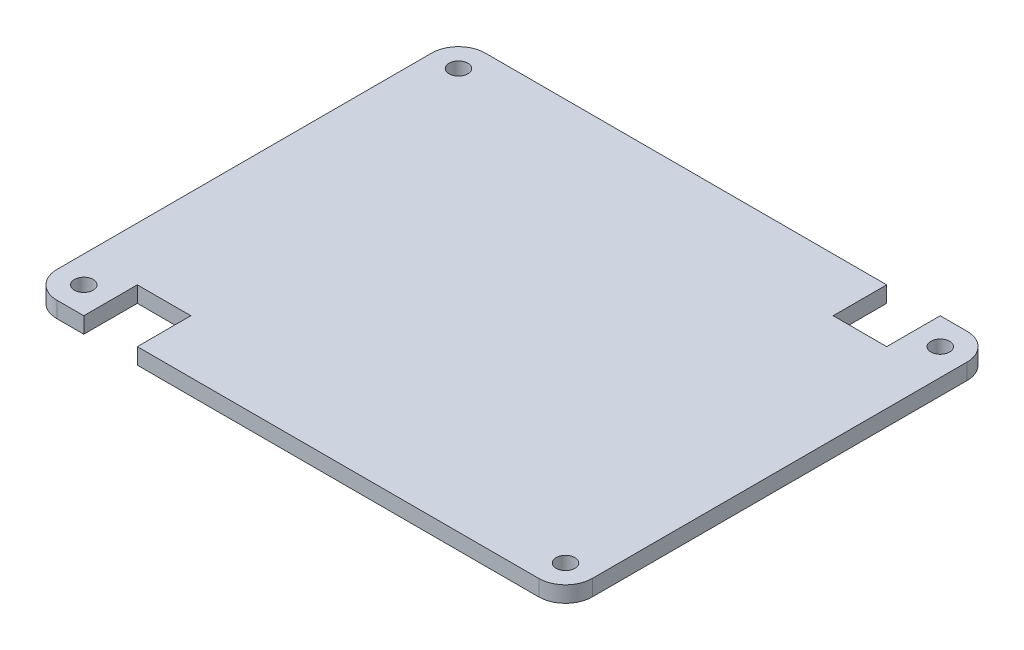
ISO-10303-21;
HEADER;
FILE_DESCRIPTION(('STEP AP214'),'2;1');
FILE_NAME('part.step','',(''),(''),'','','');
FILE_SCHEMA(('AUTOMOTIVE_DESIGN { 1 0 10303 214 1 1 1 1 }'));
ENDSEC;
DATA;
#1=APPLICATION_CONTEXT('core data for automotive mechanical design processes');
#2=APPLICATION_PROTOCOL_DEFINITION('international standard','automotive_design',2000,#1);
#3=PRODUCT_CONTEXT('',#1,'mechanical');
#4=PRODUCT('Part','Part','',(#3));
#5=PRODUCT_RELATED_PRODUCT_CATEGORY('part','',(#4));
#6=PRODUCT_DEFINITION_FORMATION('','',#4);
#7=PRODUCT_DEFINITION_CONTEXT('part definition',#1,'design');
#8=PRODUCT_DEFINITION('design','',#6,#7);
#9=PRODUCT_DEFINITION_SHAPE('','',#8);
#10=(LENGTH_UNIT() NAMED_UNIT(*) SI_UNIT(.MILLI.,.METRE.));
#11=(NAMED_UNIT(*) PLANE_ANGLE_UNIT() SI_UNIT($,.RADIAN.));
#12=(NAMED_UNIT(*) SI_UNIT($,.STERADIAN.) SOLID_ANGLE_UNIT());
#13=UNCERTAINTY_MEASURE_WITH_UNIT(LENGTH_MEASURE(1.E-05),#10,'distance_accuracy_value','');
#14=(GEOMETRIC_REPRESENTATION_CONTEXT(3) GLOBAL_UNCERTAINTY_ASSIGNED_CONTEXT((#13)) GLOBAL_UNIT_ASSIGNED_CONTEXT((#10,
#11,#12)) REPRESENTATION_CONTEXT('',''));
#15=CARTESIAN_POINT('',(0.,0.,0.));
#16=DIRECTION('',(0.,0.,1.));
#17=DIRECTION('',(1.,0.,0.));
#18=AXIS2_PLACEMENT_3D('',#15,#16,#17);
#19=CARTESIAN_POINT('',(-45.,3.,-40.));
#20=DIRECTION('',(0.,0.,1.));
#21=DIRECTION('',(1.,0.,0.));
#22=AXIS2_PLACEMENT_3D('',#19,#20,#21);
#23=PLANE('',#22);
#24=DIRECTION('',(-1.,0.,0.));
#25=VECTOR('',#24,1.);
#26=CARTESIAN_POINT('',(-45.,3.,-40.));
#27=LINE('',#26,#25);
#28=CARTESIAN_POINT('',(30.,3.,-40.));
#29=VERTEX_POINT('',#28);
#30=CARTESIAN_POINT('',(-45.,3.,-40.));
#31=VERTEX_POINT('',#30);
#32=EDGE_CURVE('E238',#29,#31,#27,.T.);
#33=ORIENTED_EDGE('',*,*,#32,.F.);
#34=DIRECTION('',(0.,1.,0.));
#35=VECTOR('',#34,1.);
#36=CARTESIAN_POINT('',(30.,0.,-40.));
#37=LINE('',#36,#35);
#38=CARTESIAN_POINT('',(30.,0.,-40.));
#39=VERTEX_POINT('',#38);
#40=EDGE_CURVE('E272',#39,#29,#37,.T.);
#41=ORIENTED_EDGE('',*,*,#40,.F.);
#42=DIRECTION('',(-1.,0.,0.));
#43=VECTOR('',#42,1.);
#44=CARTESIAN_POINT('',(-45.,0.,-40.));
#45=LINE('',#44,#43);
#46=CARTESIAN_POINT('',(-45.,0.,-40.));
#47=VERTEX_POINT('',#46);
#48=EDGE_CURVE('E213',#39,#47,#45,.T.);
#49=ORIENTED_EDGE('',*,*,#48,.T.);
#50=DIRECTION('',(0.,-1.,0.));
#51=VECTOR('',#50,1.);
#52=CARTESIAN_POINT('',(-45.,3.,-40.));
#53=LINE('',#52,#51);
#54=EDGE_CURVE('E41',#31,#47,#53,.T.);
#55=ORIENTED_EDGE('',*,*,#54,.F.);
#56=EDGE_LOOP('',(#33,#41,#49,#55));
#57=FACE_BOUND('',#56,.T.);
#58=ADVANCED_FACE('F33',(#57),#23,.F.);
#59=CARTESIAN_POINT('',(-45.,3.,40.));
#60=DIRECTION('',(0.,0.,-1.));
#61=DIRECTION('',(-1.,0.,0.));
#62=AXIS2_PLACEMENT_3D('',#59,#60,#61);
#63=PLANE('',#62);
#64=DIRECTION('',(1.,0.,0.));
#65=VECTOR('',#64,1.);
#66=CARTESIAN_POINT('',(-45.,0.,40.));
#67=LINE('',#66,#65);
#68=CARTESIAN_POINT('',(-45.,0.,40.));
#69=VERTEX_POINT('',#68);
#70=CARTESIAN_POINT('',(-40.,0.,40.));
#71=VERTEX_POINT('',#70);
#72=EDGE_CURVE('E163',#69,#71,#67,.T.);
#73=ORIENTED_EDGE('',*,*,#72,.T.);
#74=DIRECTION('',(0.,1.,0.));
#75=VECTOR('',#74,1.);
#76=CARTESIAN_POINT('',(-40.,0.,40.));
#77=LINE('',#76,#75);
#78=CARTESIAN_POINT('',(-40.,3.,40.));
#79=VERTEX_POINT('',#78);
#80=EDGE_CURVE('E146',#71,#79,#77,.T.);
#81=ORIENTED_EDGE('',*,*,#80,.T.);
#82=DIRECTION('',(1.,0.,0.));
#83=VECTOR('',#82,1.);
#84=CARTESIAN_POINT('',(-45.,3.,40.));
#85=LINE('',#84,#83);
#86=CARTESIAN_POINT('',(-45.,3.,40.));
#87=VERTEX_POINT('',#86);
#88=EDGE_CURVE('E227',#87,#79,#85,.T.);
#89=ORIENTED_EDGE('',*,*,#88,.F.);
#90=DIRECTION('',(0.,-1.,0.));
#91=VECTOR('',#90,1.);
#92=CARTESIAN_POINT('',(-45.,3.,40.));
#93=LINE('',#92,#91);
#94=EDGE_CURVE('E171',#87,#69,#93,.T.);
#95=ORIENTED_EDGE('',*,*,#94,.T.);
#96=EDGE_LOOP('',(#73,#81,#89,#95));
#97=FACE_BOUND('',#96,.T.);
#98=ADVANCED_FACE('F169',(#97),#63,.F.);
#99=CARTESIAN_POINT('',(45.,3.,-35.));
#100=DIRECTION('',(0.,-1.,0.));
#101=DIRECTION('',(0.,0.,-1.));
#102=AXIS2_PLACEMENT_3D('',#99,#100,#101);
#103=CYLINDRICAL_SURFACE('',#102,5.);
#104=CARTESIAN_POINT('',(45.,0.,-35.));
#105=DIRECTION('',(0.,1.,0.));
#106=DIRECTION('',(0.,0.,-1.));
#107=AXIS2_PLACEMENT_3D('',#104,#105,#106);
#108=CIRCLE('',#107,5.);
#109=CARTESIAN_POINT('',(50.,0.,-35.));
#110=VERTEX_POINT('',#109);
#111=CARTESIAN_POINT('',(45.,0.,-40.));
#112=VERTEX_POINT('',#111);
#113=EDGE_CURVE('E220',#110,#112,#108,.T.);
#114=ORIENTED_EDGE('',*,*,#113,.T.);
#115=DIRECTION('',(0.,-1.,0.));
#116=VECTOR('',#115,1.);
#117=CARTESIAN_POINT('',(45.,3.,-40.));
#118=LINE('',#117,#116);
#119=CARTESIAN_POINT('',(45.,3.,-40.));
#120=VERTEX_POINT('',#119);
#121=EDGE_CURVE('E11',#120,#112,#118,.T.);
#122=ORIENTED_EDGE('',*,*,#121,.F.);
#123=CARTESIAN_POINT('',(45.,3.,-35.));
#124=DIRECTION('',(0.,1.,0.));
#125=DIRECTION('',(0.,0.,-1.));
#126=AXIS2_PLACEMENT_3D('',#123,#124,#125);
#127=CIRCLE('',#126,5.);
#128=CARTESIAN_POINT('',(50.,3.,-35.));
#129=VERTEX_POINT('',#128);
#130=EDGE_CURVE('E182',#129,#120,#127,.T.);
#131=ORIENTED_EDGE('',*,*,#130,.F.);
#132=DIRECTION('',(0.,-1.,0.));
#133=VECTOR('',#132,1.);
#134=CARTESIAN_POINT('',(50.,3.,-35.));
#135=LINE('',#134,#133);
#136=EDGE_CURVE('E183',#129,#110,#135,.T.);
#137=ORIENTED_EDGE('',*,*,#136,.T.);
#138=EDGE_LOOP('',(#114,#122,#131,#137));
#139=FACE_BOUND('',#138,.T.);
#140=ADVANCED_FACE('F35',(#139),#103,.T.);
#141=CARTESIAN_POINT('',(40.,0.,-40.));
#142=VERTEX_POINT('',#141);
#143=EDGE_CURVE('E215',#112,#142,#45,.T.);
#144=ORIENTED_EDGE('',*,*,#143,.T.);
#145=DIRECTION('',(0.,1.,0.));
#146=VECTOR('',#145,1.);
#147=CARTESIAN_POINT('',(40.,0.,-40.));
#148=LINE('',#147,#146);
#149=CARTESIAN_POINT('',(40.,3.,-40.));
#150=VERTEX_POINT('',#149);
#151=EDGE_CURVE('E269',#142,#150,#148,.T.);
#152=ORIENTED_EDGE('',*,*,#151,.T.);
#153=EDGE_CURVE('E235',#120,#150,#27,.T.);
#154=ORIENTED_EDGE('',*,*,#153,.F.);
#155=ORIENTED_EDGE('',*,*,#121,.T.);
#156=EDGE_LOOP('',(#144,#152,#154,#155));
#157=FACE_BOUND('',#156,.T.);
#158=ADVANCED_FACE('F325',(#157),#23,.F.);
#159=CARTESIAN_POINT('',(-45.,3.,-35.));
#160=DIRECTION('',(0.,-1.,0.));
#161=DIRECTION('',(0.,0.,-1.));
#162=AXIS2_PLACEMENT_3D('',#159,#160,#161);
#163=CYLINDRICAL_SURFACE('',#162,4.99999999999999);
#164=CARTESIAN_POINT('',(-45.,0.,-35.));
#165=DIRECTION('',(0.,1.,0.));
#166=DIRECTION('',(0.,0.,1.));
#167=AXIS2_PLACEMENT_3D('',#164,#165,#166);
#168=CIRCLE('',#167,4.99999999999999);
#169=CARTESIAN_POINT('',(-50.,0.,-35.));
#170=VERTEX_POINT('',#169);
#171=EDGE_CURVE('E206',#47,#170,#168,.T.);
#172=ORIENTED_EDGE('',*,*,#171,.T.);
#173=DIRECTION('',(0.,-1.,0.));
#174=VECTOR('',#173,1.);
#175=CARTESIAN_POINT('',(-50.,3.,-35.));
#176=LINE('',#175,#174);
#177=CARTESIAN_POINT('',(-50.,3.,-35.));
#178=VERTEX_POINT('',#177);
#179=EDGE_CURVE('E197',#178,#170,#176,.T.);
#180=ORIENTED_EDGE('',*,*,#179,.F.);
#181=CARTESIAN_POINT('',(-45.,3.,-35.));
#182=DIRECTION('',(0.,1.,0.));
#183=DIRECTION('',(0.,0.,1.));
#184=AXIS2_PLACEMENT_3D('',#181,#182,#183);
#185=CIRCLE('',#184,4.99999999999999);
#186=EDGE_CURVE('E207',#31,#178,#185,.T.);
#187=ORIENTED_EDGE('',*,*,#186,.F.);
#188=ORIENTED_EDGE('',*,*,#54,.T.);
#189=EDGE_LOOP('',(#172,#180,#187,#188));
#190=FACE_BOUND('',#189,.T.);
#191=ADVANCED_FACE('F204',(#190),#163,.T.);
#192=CARTESIAN_POINT('',(-50.,3.,-35.));
#193=DIRECTION('',(1.,0.,0.));
#194=DIRECTION('',(0.,0.,-1.));
#195=AXIS2_PLACEMENT_3D('',#192,#193,#194);
#196=PLANE('',#195);
#197=DIRECTION('',(0.,0.,1.));
#198=VECTOR('',#197,1.);
#199=CARTESIAN_POINT('',(-50.,0.,-35.));
#200=LINE('',#199,#198);
#201=CARTESIAN_POINT('',(-50.,0.,35.));
#202=VERTEX_POINT('',#201);
#203=EDGE_CURVE('E214',#170,#202,#200,.T.);
#204=ORIENTED_EDGE('',*,*,#203,.T.);
#205=DIRECTION('',(0.,-1.,0.));
#206=VECTOR('',#205,1.);
#207=CARTESIAN_POINT('',(-50.,3.,35.));
#208=LINE('',#207,#206);
#209=CARTESIAN_POINT('',(-50.,3.,35.));
#210=VERTEX_POINT('',#209);
#211=EDGE_CURVE('E194',#210,#202,#208,.T.);
#212=ORIENTED_EDGE('',*,*,#211,.F.);
#213=DIRECTION('',(0.,0.,1.));
#214=VECTOR('',#213,1.);
#215=CARTESIAN_POINT('',(-50.,3.,-35.));
#216=LINE('',#215,#214);
#217=EDGE_CURVE('E232',#178,#210,#216,.T.);
#218=ORIENTED_EDGE('',*,*,#217,.F.);
#219=ORIENTED_EDGE('',*,*,#179,.T.);
#220=EDGE_LOOP('',(#204,#212,#218,#219));
#221=FACE_BOUND('',#220,.T.);
#222=ADVANCED_FACE('F337',(#221),#196,.F.);
#223=CARTESIAN_POINT('',(-45.,3.,35.));
#224=DIRECTION('',(0.,-1.,0.));
#225=DIRECTION('',(0.,0.,-1.));
#226=AXIS2_PLACEMENT_3D('',#223,#224,#225);
#227=CYLINDRICAL_SURFACE('',#226,4.99999999999999);
#228=CARTESIAN_POINT('',(-45.,0.,35.));
#229=DIRECTION('',(0.,1.,0.));
#230=DIRECTION('',(0.,0.,1.));
#231=AXIS2_PLACEMENT_3D('',#228,#229,#230);
#232=CIRCLE('',#231,4.99999999999999);
#233=EDGE_CURVE('E177',#202,#69,#232,.T.);
#234=ORIENTED_EDGE('',*,*,#233,.T.);
#235=ORIENTED_EDGE('',*,*,#94,.F.);
#236=CARTESIAN_POINT('',(-45.,3.,35.));
#237=DIRECTION('',(0.,1.,0.));
#238=DIRECTION('',(0.,0.,1.));
#239=AXIS2_PLACEMENT_3D('',#236,#237,#238);
#240=CIRCLE('',#239,4.99999999999999);
#241=EDGE_CURVE('E230',#210,#87,#240,.T.);
#242=ORIENTED_EDGE('',*,*,#241,.F.);
#243=ORIENTED_EDGE('',*,*,#211,.T.);
#244=EDGE_LOOP('',(#234,#235,#242,#243));
#245=FACE_BOUND('',#244,.T.);
#246=ADVANCED_FACE('F362',(#245),#227,.T.);
#247=CARTESIAN_POINT('',(-30.,3.,40.));
#248=VERTEX_POINT('',#247);
#249=CARTESIAN_POINT('',(45.,3.,40.));
#250=VERTEX_POINT('',#249);
#251=EDGE_CURVE('E229',#248,#250,#85,.T.);
#252=ORIENTED_EDGE('',*,*,#251,.F.);
#253=DIRECTION('',(0.,1.,0.));
#254=VECTOR('',#253,1.);
#255=CARTESIAN_POINT('',(-30.,0.,40.));
#256=LINE('',#255,#254);
#257=CARTESIAN_POINT('',(-30.,0.,40.));
#258=VERTEX_POINT('',#257);
#259=EDGE_CURVE('E156',#258,#248,#256,.T.);
#260=ORIENTED_EDGE('',*,*,#259,.F.);
#261=CARTESIAN_POINT('',(45.,0.,40.));
#262=VERTEX_POINT('',#261);
#263=EDGE_CURVE('E173',#258,#262,#67,.T.);
#264=ORIENTED_EDGE('',*,*,#263,.T.);
#265=DIRECTION('',(0.,-1.,0.));
#266=VECTOR('',#265,1.);
#267=CARTESIAN_POINT('',(45.,3.,40.));
#268=LINE('',#267,#266);
#269=EDGE_CURVE('E190',#250,#262,#268,.T.);
#270=ORIENTED_EDGE('',*,*,#269,.F.);
#271=EDGE_LOOP('',(#252,#260,#264,#270));
#272=FACE_BOUND('',#271,.T.);
#273=ADVANCED_FACE('F307',(#272),#63,.F.);
#274=CARTESIAN_POINT('',(45.,3.,35.));
#275=DIRECTION('',(0.,-1.,0.));
#276=DIRECTION('',(0.,0.,-1.));
#277=AXIS2_PLACEMENT_3D('',#274,#275,#276);
#278=CYLINDRICAL_SURFACE('',#277,4.99999999999999);
#279=CARTESIAN_POINT('',(45.,0.,35.));
#280=DIRECTION('',(0.,1.,0.));
#281=DIRECTION('',(0.,0.,1.));
#282=AXIS2_PLACEMENT_3D('',#279,#280,#281);
#283=CIRCLE('',#282,4.99999999999999);
#284=CARTESIAN_POINT('',(50.,0.,35.));
#285=VERTEX_POINT('',#284);
#286=EDGE_CURVE('E172',#262,#285,#283,.T.);
#287=ORIENTED_EDGE('',*,*,#286,.T.);
#288=DIRECTION('',(0.,-1.,0.));
#289=VECTOR('',#288,1.);
#290=CARTESIAN_POINT('',(50.,3.,35.));
#291=LINE('',#290,#289);
#292=CARTESIAN_POINT('',(50.,3.,35.));
#293=VERTEX_POINT('',#292);
#294=EDGE_CURVE('E186',#293,#285,#291,.T.);
#295=ORIENTED_EDGE('',*,*,#294,.F.);
#296=CARTESIAN_POINT('',(45.,3.,35.));
#297=DIRECTION('',(0.,1.,0.));
#298=DIRECTION('',(0.,0.,1.));
#299=AXIS2_PLACEMENT_3D('',#296,#297,#298);
#300=CIRCLE('',#299,4.99999999999999);
#301=EDGE_CURVE('E225',#250,#293,#300,.T.);
#302=ORIENTED_EDGE('',*,*,#301,.F.);
#303=ORIENTED_EDGE('',*,*,#269,.T.);
#304=EDGE_LOOP('',(#287,#295,#302,#303));
#305=FACE_BOUND('',#304,.T.);
#306=ADVANCED_FACE('F354',(#305),#278,.T.);
#307=CARTESIAN_POINT('',(50.,3.,-35.));
#308=DIRECTION('',(-1.,0.,0.));
#309=DIRECTION('',(0.,0.,1.));
#310=AXIS2_PLACEMENT_3D('',#307,#308,#309);
#311=PLANE('',#310);
#312=DIRECTION('',(0.,0.,-1.));
#313=VECTOR('',#312,1.);
#314=CARTESIAN_POINT('',(50.,0.,-35.));
#315=LINE('',#314,#313);
#316=EDGE_CURVE('E175',#285,#110,#315,.T.);
#317=ORIENTED_EDGE('',*,*,#316,.T.);
#318=ORIENTED_EDGE('',*,*,#136,.F.);
#319=DIRECTION('',(0.,0.,-1.));
#320=VECTOR('',#319,1.);
#321=CARTESIAN_POINT('',(50.,3.,-35.));
#322=LINE('',#321,#320);
#323=EDGE_CURVE('E187',#293,#129,#322,.T.);
#324=ORIENTED_EDGE('',*,*,#323,.F.);
#325=ORIENTED_EDGE('',*,*,#294,.T.);
#326=EDGE_LOOP('',(#317,#318,#324,#325));
#327=FACE_BOUND('',#326,.T.);
#328=ADVANCED_FACE('F352',(#327),#311,.F.);
#329=CARTESIAN_POINT('',(45.,3.,-35.));
#330=DIRECTION('',(0.,-1.,0.));
#331=DIRECTION('',(0.,0.,-1.));
#332=AXIS2_PLACEMENT_3D('',#329,#330,#331);
#333=PLANE('',#332);
#334=CARTESIAN_POINT('',(45.,3.,35.));
#335=DIRECTION('',(0.,1.,0.));
#336=DIRECTION('',(0.,0.,1.));
#337=AXIS2_PLACEMENT_3D('',#334,#335,#336);
#338=CIRCLE('',#337,1.75);
#339=CARTESIAN_POINT('',(45.,3.,36.75));
#340=VERTEX_POINT('',#339);
#341=EDGE_CURVE('E260',#340,#340,#338,.T.);
#342=ORIENTED_EDGE('',*,*,#341,.F.);
#343=EDGE_LOOP('',(#342));
#344=FACE_BOUND('',#343,.T.);
#345=CARTESIAN_POINT('',(-45.,3.,-35.));
#346=DIRECTION('',(0.,1.,0.));
#347=DIRECTION('',(0.,0.,1.));
#348=AXIS2_PLACEMENT_3D('',#345,#346,#347);
#349=CIRCLE('',#348,1.75);
#350=CARTESIAN_POINT('',(-45.,3.,-33.25));
#351=VERTEX_POINT('',#350);
#352=EDGE_CURVE('E254',#351,#351,#349,.T.);
#353=ORIENTED_EDGE('',*,*,#352,.F.);
#354=EDGE_LOOP('',(#353));
#355=FACE_BOUND('',#354,.T.);
#356=CARTESIAN_POINT('',(45.,3.,-35.));
#357=DIRECTION('',(0.,1.,0.));
#358=DIRECTION('',(0.,0.,1.));
#359=AXIS2_PLACEMENT_3D('',#356,#357,#358);
#360=CIRCLE('',#359,1.75);
#361=CARTESIAN_POINT('',(45.,3.,-33.25));
#362=VERTEX_POINT('',#361);
#363=EDGE_CURVE('E247',#362,#362,#360,.T.);
#364=ORIENTED_EDGE('',*,*,#363,.F.);
#365=EDGE_LOOP('',(#364));
#366=FACE_BOUND('',#365,.T.);
#367=CARTESIAN_POINT('',(-45.,3.,35.));
#368=DIRECTION('',(0.,1.,0.));
#369=DIRECTION('',(0.,0.,1.));
#370=AXIS2_PLACEMENT_3D('',#367,#368,#369);
#371=CIRCLE('',#370,1.75);
#372=CARTESIAN_POINT('',(-45.,3.,36.75));
#373=VERTEX_POINT('',#372);
#374=EDGE_CURVE('E241',#373,#373,#371,.T.);
#375=ORIENTED_EDGE('',*,*,#374,.F.);
#376=EDGE_LOOP('',(#375));
#377=FACE_BOUND('',#376,.T.);
#378=ORIENTED_EDGE('',*,*,#88,.T.);
#379=DIRECTION('',(0.,0.,1.));
#380=VECTOR('',#379,1.);
#381=CARTESIAN_POINT('',(-40.,3.,40.));
#382=LINE('',#381,#380);
#383=CARTESIAN_POINT('',(-40.,3.,30.));
#384=VERTEX_POINT('',#383);
#385=EDGE_CURVE('E151',#384,#79,#382,.T.);
#386=ORIENTED_EDGE('',*,*,#385,.F.);
#387=DIRECTION('',(-1.,0.,0.));
#388=VECTOR('',#387,1.);
#389=CARTESIAN_POINT('',(-40.,3.,30.));
#390=LINE('',#389,#388);
#391=CARTESIAN_POINT('',(-30.,3.,30.));
#392=VERTEX_POINT('',#391);
#393=EDGE_CURVE('E166',#392,#384,#390,.T.);
#394=ORIENTED_EDGE('',*,*,#393,.F.);
#395=DIRECTION('',(0.,0.,-1.));
#396=VECTOR('',#395,1.);
#397=CARTESIAN_POINT('',(-30.,3.,40.));
#398=LINE('',#397,#396);
#399=EDGE_CURVE('E294',#248,#392,#398,.T.);
#400=ORIENTED_EDGE('',*,*,#399,.F.);
#401=ORIENTED_EDGE('',*,*,#251,.T.);
#402=ORIENTED_EDGE('',*,*,#301,.T.);
#403=ORIENTED_EDGE('',*,*,#323,.T.);
#404=ORIENTED_EDGE('',*,*,#130,.T.);
#405=ORIENTED_EDGE('',*,*,#153,.T.);
#406=DIRECTION('',(0.,0.,-1.));
#407=VECTOR('',#406,1.);
#408=CARTESIAN_POINT('',(40.,3.,-40.));
#409=LINE('',#408,#407);
#410=CARTESIAN_POINT('',(40.,3.,-30.));
#411=VERTEX_POINT('',#410);
#412=EDGE_CURVE('E274',#411,#150,#409,.T.);
#413=ORIENTED_EDGE('',*,*,#412,.F.);
#414=DIRECTION('',(1.,0.,0.));
#415=VECTOR('',#414,1.);
#416=CARTESIAN_POINT('',(30.,3.,-30.));
#417=LINE('',#416,#415);
#418=CARTESIAN_POINT('',(30.,3.,-30.));
#419=VERTEX_POINT('',#418);
#420=EDGE_CURVE('E277',#419,#411,#417,.T.);
#421=ORIENTED_EDGE('',*,*,#420,.F.);
#422=DIRECTION('',(0.,0.,1.));
#423=VECTOR('',#422,1.);
#424=CARTESIAN_POINT('',(30.,3.,-40.));
#425=LINE('',#424,#423);
#426=EDGE_CURVE('E280',#29,#419,#425,.T.);
#427=ORIENTED_EDGE('',*,*,#426,.F.);
#428=ORIENTED_EDGE('',*,*,#32,.T.);
#429=ORIENTED_EDGE('',*,*,#186,.T.);
#430=ORIENTED_EDGE('',*,*,#217,.T.);
#431=ORIENTED_EDGE('',*,*,#241,.T.);
#432=EDGE_LOOP('',(#378,#386,#394,#400,#401,#402,#403,#404,#405,#413,#421,#427,#428,#429,#430,#431));
#433=FACE_BOUND('',#432,.T.);
#434=ADVANCED_FACE('F311',(#344,#355,#366,#377,#433),#333,.F.);
#435=CARTESIAN_POINT('',(45.,0.,-35.));
#436=DIRECTION('',(0.,-1.,0.));
#437=DIRECTION('',(0.,0.,-1.));
#438=AXIS2_PLACEMENT_3D('',#435,#436,#437);
#439=PLANE('',#438);
#440=DIRECTION('',(0.,0.,1.));
#441=VECTOR('',#440,1.);
#442=CARTESIAN_POINT('',(-40.,0.,40.));
#443=LINE('',#442,#441);
#444=CARTESIAN_POINT('',(-40.,0.,30.));
#445=VERTEX_POINT('',#444);
#446=EDGE_CURVE('E149',#445,#71,#443,.T.);
#447=ORIENTED_EDGE('',*,*,#446,.T.);
#448=ORIENTED_EDGE('',*,*,#72,.F.);
#449=ORIENTED_EDGE('',*,*,#233,.F.);
#450=ORIENTED_EDGE('',*,*,#203,.F.);
#451=ORIENTED_EDGE('',*,*,#171,.F.);
#452=ORIENTED_EDGE('',*,*,#48,.F.);
#453=DIRECTION('',(0.,0.,1.));
#454=VECTOR('',#453,1.);
#455=CARTESIAN_POINT('',(30.,0.,-40.));
#456=LINE('',#455,#454);
#457=CARTESIAN_POINT('',(30.,0.,-30.));
#458=VERTEX_POINT('',#457);
#459=EDGE_CURVE('E276',#39,#458,#456,.T.);
#460=ORIENTED_EDGE('',*,*,#459,.T.);
#461=DIRECTION('',(1.,0.,0.));
#462=VECTOR('',#461,1.);
#463=CARTESIAN_POINT('',(30.,0.,-30.));
#464=LINE('',#463,#462);
#465=CARTESIAN_POINT('',(40.,0.,-30.));
#466=VERTEX_POINT('',#465);
#467=EDGE_CURVE('E284',#458,#466,#464,.T.);
#468=ORIENTED_EDGE('',*,*,#467,.T.);
#469=DIRECTION('',(0.,0.,-1.));
#470=VECTOR('',#469,1.);
#471=CARTESIAN_POINT('',(40.,0.,-40.));
#472=LINE('',#471,#470);
#473=EDGE_CURVE('E56',#466,#142,#472,.T.);
#474=ORIENTED_EDGE('',*,*,#473,.T.);
#475=ORIENTED_EDGE('',*,*,#143,.F.);
#476=ORIENTED_EDGE('',*,*,#113,.F.);
#477=ORIENTED_EDGE('',*,*,#316,.F.);
#478=ORIENTED_EDGE('',*,*,#286,.F.);
#479=ORIENTED_EDGE('',*,*,#263,.F.);
#480=DIRECTION('',(0.,0.,-1.));
#481=VECTOR('',#480,1.);
#482=CARTESIAN_POINT('',(-30.,0.,40.));
#483=LINE('',#482,#481);
#484=CARTESIAN_POINT('',(-30.,0.,30.));
#485=VERTEX_POINT('',#484);
#486=EDGE_CURVE('E165',#258,#485,#483,.T.);
#487=ORIENTED_EDGE('',*,*,#486,.T.);
#488=DIRECTION('',(-1.,0.,0.));
#489=VECTOR('',#488,1.);
#490=CARTESIAN_POINT('',(-40.,0.,30.));
#491=LINE('',#490,#489);
#492=EDGE_CURVE('E48',#485,#445,#491,.T.);
#493=ORIENTED_EDGE('',*,*,#492,.T.);
#494=EDGE_LOOP('',(#447,#448,#449,#450,#451,#452,#460,#468,#474,#475,#476,#477,#478,#479,#487,#493));
#495=FACE_BOUND('',#494,.T.);
#496=CARTESIAN_POINT('',(45.,0.,35.));
#497=DIRECTION('',(0.,1.,0.));
#498=DIRECTION('',(0.,0.,1.));
#499=AXIS2_PLACEMENT_3D('',#496,#497,#498);
#500=CIRCLE('',#499,1.75);
#501=CARTESIAN_POINT('',(45.,0.,36.75));
#502=VERTEX_POINT('',#501);
#503=EDGE_CURVE('E244',#502,#502,#500,.T.);
#504=ORIENTED_EDGE('',*,*,#503,.T.);
#505=EDGE_LOOP('',(#504));
#506=FACE_BOUND('',#505,.T.);
#507=CARTESIAN_POINT('',(-45.,0.,-35.));
#508=DIRECTION('',(0.,1.,0.));
#509=DIRECTION('',(0.,0.,1.));
#510=AXIS2_PLACEMENT_3D('',#507,#508,#509);
#511=CIRCLE('',#510,1.75);
#512=CARTESIAN_POINT('',(-45.,0.,-33.25));
#513=VERTEX_POINT('',#512);
#514=EDGE_CURVE('E257',#513,#513,#511,.T.);
#515=ORIENTED_EDGE('',*,*,#514,.T.);
#516=EDGE_LOOP('',(#515));
#517=FACE_BOUND('',#516,.T.);
#518=CARTESIAN_POINT('',(45.,0.,-35.));
#519=DIRECTION('',(0.,1.,0.));
#520=DIRECTION('',(0.,0.,1.));
#521=AXIS2_PLACEMENT_3D('',#518,#519,#520);
#522=CIRCLE('',#521,1.75);
#523=CARTESIAN_POINT('',(45.,0.,-33.25));
#524=VERTEX_POINT('',#523);
#525=EDGE_CURVE('E250',#524,#524,#522,.T.);
#526=ORIENTED_EDGE('',*,*,#525,.T.);
#527=EDGE_LOOP('',(#526));
#528=FACE_BOUND('',#527,.T.);
#529=CARTESIAN_POINT('',(-45.,0.,35.));
#530=DIRECTION('',(0.,1.,0.));
#531=DIRECTION('',(0.,0.,1.));
#532=AXIS2_PLACEMENT_3D('',#529,#530,#531);
#533=CIRCLE('',#532,1.75);
#534=CARTESIAN_POINT('',(-45.,0.,36.75));
#535=VERTEX_POINT('',#534);
#536=EDGE_CURVE('E223',#535,#535,#533,.T.);
#537=ORIENTED_EDGE('',*,*,#536,.T.);
#538=EDGE_LOOP('',(#537));
#539=FACE_BOUND('',#538,.T.);
#540=ADVANCED_FACE('F160',(#495,#506,#517,#528,#539),#439,.T.);
#541=CARTESIAN_POINT('',(-45.,0.,35.));
#542=DIRECTION('',(0.,1.,0.));
#543=DIRECTION('',(0.,0.,1.));
#544=AXIS2_PLACEMENT_3D('',#541,#542,#543);
#545=CYLINDRICAL_SURFACE('',#544,1.75);
#546=ORIENTED_EDGE('',*,*,#536,.F.);
#547=EDGE_LOOP('',(#546));
#548=FACE_BOUND('',#547,.T.);
#549=ORIENTED_EDGE('',*,*,#374,.T.);
#550=EDGE_LOOP('',(#549));
#551=FACE_BOUND('',#550,.T.);
#552=ADVANCED_FACE('F397',(#548,#551),#545,.F.);
#553=CARTESIAN_POINT('',(45.,0.,-35.));
#554=DIRECTION('',(0.,1.,0.));
#555=DIRECTION('',(0.,0.,1.));
#556=AXIS2_PLACEMENT_3D('',#553,#554,#555);
#557=CYLINDRICAL_SURFACE('',#556,1.75);
#558=ORIENTED_EDGE('',*,*,#525,.F.);
#559=EDGE_LOOP('',(#558));
#560=FACE_BOUND('',#559,.T.);
#561=ORIENTED_EDGE('',*,*,#363,.T.);
#562=EDGE_LOOP('',(#561));
#563=FACE_BOUND('',#562,.T.);
#564=ADVANCED_FACE('F393',(#560,#563),#557,.F.);
#565=CARTESIAN_POINT('',(-45.,0.,-35.));
#566=DIRECTION('',(0.,1.,0.));
#567=DIRECTION('',(0.,0.,1.));
#568=AXIS2_PLACEMENT_3D('',#565,#566,#567);
#569=CYLINDRICAL_SURFACE('',#568,1.75);
#570=ORIENTED_EDGE('',*,*,#514,.F.);
#571=EDGE_LOOP('',(#570));
#572=FACE_BOUND('',#571,.T.);
#573=ORIENTED_EDGE('',*,*,#352,.T.);
#574=EDGE_LOOP('',(#573));
#575=FACE_BOUND('',#574,.T.);
#576=ADVANCED_FACE('F386',(#572,#575),#569,.F.);
#577=CARTESIAN_POINT('',(45.,0.,35.));
#578=DIRECTION('',(0.,1.,0.));
#579=DIRECTION('',(0.,0.,1.));
#580=AXIS2_PLACEMENT_3D('',#577,#578,#579);
#581=CYLINDRICAL_SURFACE('',#580,1.75);
#582=ORIENTED_EDGE('',*,*,#503,.F.);
#583=EDGE_LOOP('',(#582));
#584=FACE_BOUND('',#583,.T.);
#585=ORIENTED_EDGE('',*,*,#341,.T.);
#586=EDGE_LOOP('',(#585));
#587=FACE_BOUND('',#586,.T.);
#588=ADVANCED_FACE('F379',(#584,#587),#581,.F.);
#589=CARTESIAN_POINT('',(30.,0.,-40.));
#590=DIRECTION('',(-1.,0.,0.));
#591=DIRECTION('',(0.,0.,1.));
#592=AXIS2_PLACEMENT_3D('',#589,#590,#591);
#593=PLANE('',#592);
#594=ORIENTED_EDGE('',*,*,#426,.T.);
#595=DIRECTION('',(0.,1.,0.));
#596=VECTOR('',#595,1.);
#597=CARTESIAN_POINT('',(30.,0.,-30.));
#598=LINE('',#597,#596);
#599=EDGE_CURVE('E265',#458,#419,#598,.T.);
#600=ORIENTED_EDGE('',*,*,#599,.F.);
#601=ORIENTED_EDGE('',*,*,#459,.F.);
#602=ORIENTED_EDGE('',*,*,#40,.T.);
#603=EDGE_LOOP('',(#594,#600,#601,#602));
#604=FACE_BOUND('',#603,.T.);
#605=ADVANCED_FACE('F377',(#604),#593,.F.);
#606=CARTESIAN_POINT('',(40.,0.,-40.));
#607=DIRECTION('',(1.,0.,0.));
#608=DIRECTION('',(0.,0.,-1.));
#609=AXIS2_PLACEMENT_3D('',#606,#607,#608);
#610=PLANE('',#609);
#611=ORIENTED_EDGE('',*,*,#412,.T.);
#612=ORIENTED_EDGE('',*,*,#151,.F.);
#613=ORIENTED_EDGE('',*,*,#473,.F.);
#614=DIRECTION('',(0.,1.,0.));
#615=VECTOR('',#614,1.);
#616=CARTESIAN_POINT('',(40.,0.,-30.));
#617=LINE('',#616,#615);
#618=EDGE_CURVE('E267',#466,#411,#617,.T.);
#619=ORIENTED_EDGE('',*,*,#618,.T.);
#620=EDGE_LOOP('',(#611,#612,#613,#619));
#621=FACE_BOUND('',#620,.T.);
#622=ADVANCED_FACE('F346',(#621),#610,.F.);
#623=CARTESIAN_POINT('',(30.,0.,-30.));
#624=DIRECTION('',(0.,0.,1.));
#625=DIRECTION('',(1.,0.,0.));
#626=AXIS2_PLACEMENT_3D('',#623,#624,#625);
#627=PLANE('',#626);
#628=ORIENTED_EDGE('',*,*,#420,.T.);
#629=ORIENTED_EDGE('',*,*,#618,.F.);
#630=ORIENTED_EDGE('',*,*,#467,.F.);
#631=ORIENTED_EDGE('',*,*,#599,.T.);
#632=EDGE_LOOP('',(#628,#629,#630,#631));
#633=FACE_BOUND('',#632,.T.);
#634=ADVANCED_FACE('F322',(#633),#627,.F.);
#635=CARTESIAN_POINT('',(-40.,0.,40.));
#636=DIRECTION('',(-1.,0.,0.));
#637=DIRECTION('',(0.,0.,1.));
#638=AXIS2_PLACEMENT_3D('',#635,#636,#637);
#639=PLANE('',#638);
#640=ORIENTED_EDGE('',*,*,#385,.T.);
#641=ORIENTED_EDGE('',*,*,#80,.F.);
#642=ORIENTED_EDGE('',*,*,#446,.F.);
#643=DIRECTION('',(0.,1.,0.));
#644=VECTOR('',#643,1.);
#645=CARTESIAN_POINT('',(-40.,0.,30.));
#646=LINE('',#645,#644);
#647=EDGE_CURVE('E251',#445,#384,#646,.T.);
#648=ORIENTED_EDGE('',*,*,#647,.T.);
#649=EDGE_LOOP('',(#640,#641,#642,#648));
#650=FACE_BOUND('',#649,.T.);
#651=ADVANCED_FACE('F148',(#650),#639,.F.);
#652=CARTESIAN_POINT('',(-40.,0.,30.));
#653=DIRECTION('',(0.,0.,-1.));
#654=DIRECTION('',(-1.,0.,0.));
#655=AXIS2_PLACEMENT_3D('',#652,#653,#654);
#656=PLANE('',#655);
#657=ORIENTED_EDGE('',*,*,#393,.T.);
#658=ORIENTED_EDGE('',*,*,#647,.F.);
#659=ORIENTED_EDGE('',*,*,#492,.F.);
#660=DIRECTION('',(0.,1.,0.));
#661=VECTOR('',#660,1.);
#662=CARTESIAN_POINT('',(-30.,0.,30.));
#663=LINE('',#662,#661);
#664=EDGE_CURVE('E289',#485,#392,#663,.T.);
#665=ORIENTED_EDGE('',*,*,#664,.T.);
#666=EDGE_LOOP('',(#657,#658,#659,#665));
#667=FACE_BOUND('',#666,.T.);
#668=ADVANCED_FACE('F314',(#667),#656,.F.);
#669=CARTESIAN_POINT('',(-30.,0.,40.));
#670=DIRECTION('',(1.,0.,0.));
#671=DIRECTION('',(0.,0.,-1.));
#672=AXIS2_PLACEMENT_3D('',#669,#670,#671);
#673=PLANE('',#672);
#674=ORIENTED_EDGE('',*,*,#399,.T.);
#675=ORIENTED_EDGE('',*,*,#664,.F.);
#676=ORIENTED_EDGE('',*,*,#486,.F.);
#677=ORIENTED_EDGE('',*,*,#259,.T.);
#678=EDGE_LOOP('',(#674,#675,#676,#677));
#679=FACE_BOUND('',#678,.T.);
#680=ADVANCED_FACE('F303',(#679),#673,.F.);
#681=CLOSED_SHELL('',(#58,#98,#140,#158,#191,#222,#246,#273,#306,#328,#434,#540,#552,#564,#576,
#588,#605,#622,#634,#651,#668,#680));
#682=MANIFOLD_SOLID_BREP('B2',#681);
#683=ADVANCED_BREP_SHAPE_REPRESENTATION('',(#18,#682),#14);
#684=SHAPE_DEFINITION_REPRESENTATION(#9,#683);
ENDSEC;
END-ISO-10303-21;
